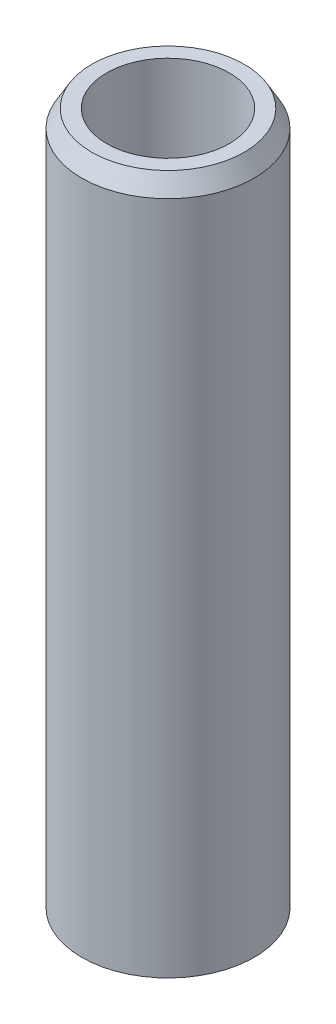
ISO-10303-21;
HEADER;
FILE_DESCRIPTION(('STEP AP214'),'2;1');
FILE_NAME('part.step','',(''),(''),'','','');
FILE_SCHEMA(('AUTOMOTIVE_DESIGN { 1 0 10303 214 1 1 1 1 }'));
ENDSEC;
DATA;
#1=APPLICATION_CONTEXT('core data for automotive mechanical design processes');
#2=APPLICATION_PROTOCOL_DEFINITION('international standard','automotive_design',2000,#1);
#3=PRODUCT_CONTEXT('',#1,'mechanical');
#4=PRODUCT('Part','Part','',(#3));
#5=PRODUCT_RELATED_PRODUCT_CATEGORY('part','',(#4));
#6=PRODUCT_DEFINITION_FORMATION('','',#4);
#7=PRODUCT_DEFINITION_CONTEXT('part definition',#1,'design');
#8=PRODUCT_DEFINITION('design','',#6,#7);
#9=PRODUCT_DEFINITION_SHAPE('','',#8);
#10=(LENGTH_UNIT() NAMED_UNIT(*) SI_UNIT(.MILLI.,.METRE.));
#11=(NAMED_UNIT(*) PLANE_ANGLE_UNIT() SI_UNIT($,.RADIAN.));
#12=(NAMED_UNIT(*) SI_UNIT($,.STERADIAN.) SOLID_ANGLE_UNIT());
#13=UNCERTAINTY_MEASURE_WITH_UNIT(LENGTH_MEASURE(1.E-05),#10,'distance_accuracy_value','');
#14=(GEOMETRIC_REPRESENTATION_CONTEXT(3) GLOBAL_UNCERTAINTY_ASSIGNED_CONTEXT((#13)) GLOBAL_UNIT_ASSIGNED_CONTEXT((#10,
#11,#12)) REPRESENTATION_CONTEXT('',''));
#15=CARTESIAN_POINT('',(0.,0.,0.));
#16=DIRECTION('',(0.,0.,1.));
#17=DIRECTION('',(1.,0.,0.));
#18=AXIS2_PLACEMENT_3D('',#15,#16,#17);
#19=CARTESIAN_POINT('',(0.,142.424779606678,0.));
#20=DIRECTION('',(0.,-1.,0.));
#21=DIRECTION('',(0.,0.,-1.));
#22=AXIS2_PLACEMENT_3D('',#19,#20,#21);
#23=CYLINDRICAL_SURFACE('',#22,17.5);
#24=CARTESIAN_POINT('',(0.,138.901298801256,0.));
#25=DIRECTION('',(0.,1.,0.));
#26=DIRECTION('',(0.,0.,1.));
#27=AXIS2_PLACEMENT_3D('',#24,#25,#26);
#28=CIRCLE('',#27,17.5);
#29=CARTESIAN_POINT('',(0.,138.901298801256,17.5));
#30=VERTEX_POINT('',#29);
#31=EDGE_CURVE('E50',#30,#30,#28,.F.);
#32=ORIENTED_EDGE('',*,*,#31,.T.);
#33=EDGE_LOOP('',(#32));
#34=FACE_BOUND('',#33,.T.);
#35=CARTESIAN_POINT('',(0.,2.03428259149507,0.));
#36=DIRECTION('',(0.,1.,0.));
#37=DIRECTION('',(0.,0.,1.));
#38=AXIS2_PLACEMENT_3D('',#35,#36,#37);
#39=CIRCLE('',#38,17.5);
#40=CARTESIAN_POINT('',(0.,2.03428259149507,17.5));
#41=VERTEX_POINT('',#40);
#42=EDGE_CURVE('E51',#41,#41,#39,.T.);
#43=ORIENTED_EDGE('',*,*,#42,.T.);
#44=EDGE_LOOP('',(#43));
#45=FACE_BOUND('',#44,.T.);
#46=ADVANCED_FACE('F39',(#34,#45),#23,.T.);
#47=CARTESIAN_POINT('',(0.,142.424779606678,0.));
#48=DIRECTION('',(0.,1.,0.));
#49=DIRECTION('',(0.,0.,1.));
#50=AXIS2_PLACEMENT_3D('',#47,#48,#49);
#51=PLANE('',#50);
#52=CARTESIAN_POINT('',(0.,142.424779606678,0.));
#53=DIRECTION('',(0.,1.,0.));
#54=DIRECTION('',(0.,0.,1.));
#55=AXIS2_PLACEMENT_3D('',#52,#53,#54);
#56=CIRCLE('',#55,15.4657174085049);
#57=CARTESIAN_POINT('',(0.,142.424779606678,15.4657174085049));
#58=VERTEX_POINT('',#57);
#59=EDGE_CURVE('E54',#58,#58,#56,.T.);
#60=ORIENTED_EDGE('',*,*,#59,.T.);
#61=EDGE_LOOP('',(#60));
#62=FACE_BOUND('',#61,.T.);
#63=CARTESIAN_POINT('',(0.,142.424779606678,0.));
#64=DIRECTION('',(0.,1.,0.));
#65=DIRECTION('',(0.,0.,1.));
#66=AXIS2_PLACEMENT_3D('',#63,#64,#65);
#67=CIRCLE('',#66,12.4401800633876);
#68=CARTESIAN_POINT('',(0.,142.424779606678,12.4401800633876));
#69=VERTEX_POINT('',#68);
#70=EDGE_CURVE('E58',#69,#69,#67,.T.);
#71=ORIENTED_EDGE('',*,*,#70,.F.);
#72=EDGE_LOOP('',(#71));
#73=FACE_BOUND('',#72,.T.);
#74=ADVANCED_FACE('F69',(#62,#73),#51,.T.);
#75=CARTESIAN_POINT('',(0.,0.,0.));
#76=DIRECTION('',(0.,1.,0.));
#77=DIRECTION('',(0.,0.,1.));
#78=AXIS2_PLACEMENT_3D('',#75,#76,#77);
#79=PLANE('',#78);
#80=CARTESIAN_POINT('',(0.,0.,0.));
#81=DIRECTION('',(0.,1.,0.));
#82=DIRECTION('',(0.,0.,1.));
#83=AXIS2_PLACEMENT_3D('',#80,#81,#82);
#84=CIRCLE('',#83,13.9765191945776);
#85=CARTESIAN_POINT('',(0.,0.,13.9765191945776));
#86=VERTEX_POINT('',#85);
#87=EDGE_CURVE('E10',#86,#86,#84,.F.);
#88=ORIENTED_EDGE('',*,*,#87,.T.);
#89=EDGE_LOOP('',(#88));
#90=FACE_BOUND('',#89,.T.);
#91=CARTESIAN_POINT('',(0.,0.,0.));
#92=DIRECTION('',(0.,1.,0.));
#93=DIRECTION('',(0.,0.,1.));
#94=AXIS2_PLACEMENT_3D('',#91,#92,#93);
#95=CIRCLE('',#94,12.4401800633876);
#96=CARTESIAN_POINT('',(0.,0.,12.4401800633876));
#97=VERTEX_POINT('',#96);
#98=EDGE_CURVE('E63',#97,#97,#95,.T.);
#99=ORIENTED_EDGE('',*,*,#98,.T.);
#100=EDGE_LOOP('',(#99));
#101=FACE_BOUND('',#100,.T.);
#102=ADVANCED_FACE('F75',(#90,#101),#79,.F.);
#103=CARTESIAN_POINT('',(0.,142.424779606678,0.));
#104=DIRECTION('',(0.,-1.,0.));
#105=DIRECTION('',(0.,0.,-1.));
#106=AXIS2_PLACEMENT_3D('',#103,#104,#105);
#107=CYLINDRICAL_SURFACE('',#106,12.4401800633876);
#108=ORIENTED_EDGE('',*,*,#70,.T.);
#109=EDGE_LOOP('',(#108));
#110=FACE_BOUND('',#109,.T.);
#111=ORIENTED_EDGE('',*,*,#98,.F.);
#112=EDGE_LOOP('',(#111));
#113=FACE_BOUND('',#112,.T.);
#114=ADVANCED_FACE('F70',(#110,#113),#107,.F.);
#115=CARTESIAN_POINT('',(0.,142.424779606678,0.));
#116=DIRECTION('',(0.,-1.,0.));
#117=DIRECTION('',(0.,0.,-1.));
#118=AXIS2_PLACEMENT_3D('',#115,#116,#117);
#119=CONICAL_SURFACE('',#118,15.4657174085049,0.523598775598295);
#120=ORIENTED_EDGE('',*,*,#31,.F.);
#121=EDGE_LOOP('',(#120));
#122=FACE_BOUND('',#121,.T.);
#123=ORIENTED_EDGE('',*,*,#59,.F.);
#124=EDGE_LOOP('',(#123));
#125=FACE_BOUND('',#124,.T.);
#126=ADVANCED_FACE('F81',(#122,#125),#119,.T.);
#127=CARTESIAN_POINT('',(0.,2.03428259149507,0.));
#128=DIRECTION('',(0.,1.,0.));
#129=DIRECTION('',(0.,0.,1.));
#130=AXIS2_PLACEMENT_3D('',#127,#128,#129);
#131=CONICAL_SURFACE('',#130,17.5,1.0471975511966);
#132=ORIENTED_EDGE('',*,*,#87,.F.);
#133=EDGE_LOOP('',(#132));
#134=FACE_BOUND('',#133,.T.);
#135=ORIENTED_EDGE('',*,*,#42,.F.);
#136=EDGE_LOOP('',(#135));
#137=FACE_BOUND('',#136,.T.);
#138=ADVANCED_FACE('F45',(#134,#137),#131,.T.);
#139=CLOSED_SHELL('',(#46,#74,#102,#114,#126,#138));
#140=MANIFOLD_SOLID_BREP('B2',#139);
#141=ADVANCED_BREP_SHAPE_REPRESENTATION('',(#18,#140),#14);
#142=SHAPE_DEFINITION_REPRESENTATION(#9,#141);
ENDSEC;
END-ISO-10303-21;
